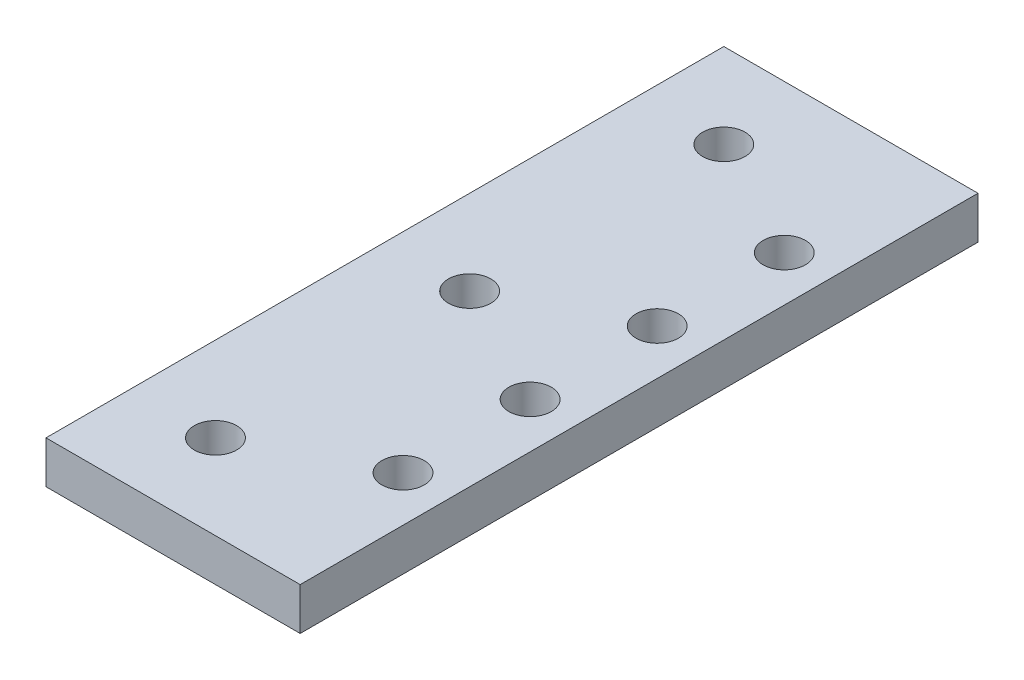
ISO-10303-21;
HEADER;
FILE_DESCRIPTION(('STEP AP214'),'2;1');
FILE_NAME('part.step','',(''),(''),'','','');
FILE_SCHEMA(('AUTOMOTIVE_DESIGN { 1 0 10303 214 1 1 1 1 }'));
ENDSEC;
DATA;
#1=APPLICATION_CONTEXT('core data for automotive mechanical design processes');
#2=APPLICATION_PROTOCOL_DEFINITION('international standard','automotive_design',2000,#1);
#3=PRODUCT_CONTEXT('',#1,'mechanical');
#4=PRODUCT('Part','Part','',(#3));
#5=PRODUCT_RELATED_PRODUCT_CATEGORY('part','',(#4));
#6=PRODUCT_DEFINITION_FORMATION('','',#4);
#7=PRODUCT_DEFINITION_CONTEXT('part definition',#1,'design');
#8=PRODUCT_DEFINITION('design','',#6,#7);
#9=PRODUCT_DEFINITION_SHAPE('','',#8);
#10=(LENGTH_UNIT() NAMED_UNIT(*) SI_UNIT(.MILLI.,.METRE.));
#11=(NAMED_UNIT(*) PLANE_ANGLE_UNIT() SI_UNIT($,.RADIAN.));
#12=(NAMED_UNIT(*) SI_UNIT($,.STERADIAN.) SOLID_ANGLE_UNIT());
#13=UNCERTAINTY_MEASURE_WITH_UNIT(LENGTH_MEASURE(1.E-05),#10,'distance_accuracy_value','');
#14=(GEOMETRIC_REPRESENTATION_CONTEXT(3) GLOBAL_UNCERTAINTY_ASSIGNED_CONTEXT((#13)) GLOBAL_UNIT_ASSIGNED_CONTEXT((#10,
#11,#12)) REPRESENTATION_CONTEXT('',''));
#15=CARTESIAN_POINT('',(0.,0.,0.));
#16=DIRECTION('',(0.,0.,1.));
#17=DIRECTION('',(1.,0.,0.));
#18=AXIS2_PLACEMENT_3D('',#15,#16,#17);
#19=CARTESIAN_POINT('',(0.,6.35,0.));
#20=DIRECTION('',(0.,-1.,0.));
#21=DIRECTION('',(0.,0.,-1.));
#22=AXIS2_PLACEMENT_3D('',#19,#20,#21);
#23=PLANE('',#22);
#24=CARTESIAN_POINT('',(18.589627450316,6.35,-28.575));
#25=DIRECTION('',(0.,1.,0.));
#26=DIRECTION('',(0.,0.,1.));
#27=AXIS2_PLACEMENT_3D('',#24,#25,#26);
#28=CIRCLE('',#27,3.175);
#29=CARTESIAN_POINT('',(18.589627450316,6.35,-25.4));
#30=VERTEX_POINT('',#29);
#31=EDGE_CURVE('E184',#30,#30,#28,.T.);
#32=ORIENTED_EDGE('',*,*,#31,.F.);
#33=EDGE_LOOP('',(#32));
#34=FACE_BOUND('',#33,.T.);
#35=CARTESIAN_POINT('',(18.589627450316,6.35,-9.525));
#36=DIRECTION('',(0.,1.,0.));
#37=DIRECTION('',(0.,0.,1.));
#38=AXIS2_PLACEMENT_3D('',#35,#36,#37);
#39=CIRCLE('',#38,3.175);
#40=CARTESIAN_POINT('',(18.589627450316,6.35,-6.35));
#41=VERTEX_POINT('',#40);
#42=EDGE_CURVE('E180',#41,#41,#39,.T.);
#43=ORIENTED_EDGE('',*,*,#42,.F.);
#44=EDGE_LOOP('',(#43));
#45=FACE_BOUND('',#44,.T.);
#46=CARTESIAN_POINT('',(18.589627450316,6.35,9.525));
#47=DIRECTION('',(0.,1.,0.));
#48=DIRECTION('',(0.,0.,1.));
#49=AXIS2_PLACEMENT_3D('',#46,#47,#48);
#50=CIRCLE('',#49,3.175);
#51=CARTESIAN_POINT('',(18.589627450316,6.35,12.7));
#52=VERTEX_POINT('',#51);
#53=EDGE_CURVE('E172',#52,#52,#50,.T.);
#54=ORIENTED_EDGE('',*,*,#53,.F.);
#55=EDGE_LOOP('',(#54));
#56=FACE_BOUND('',#55,.T.);
#57=CARTESIAN_POINT('',(18.589627450316,6.35,28.575));
#58=DIRECTION('',(0.,1.,0.));
#59=DIRECTION('',(0.,0.,1.));
#60=AXIS2_PLACEMENT_3D('',#57,#58,#59);
#61=CIRCLE('',#60,3.175);
#62=CARTESIAN_POINT('',(18.589627450316,6.35,31.75));
#63=VERTEX_POINT('',#62);
#64=EDGE_CURVE('E164',#63,#63,#61,.T.);
#65=ORIENTED_EDGE('',*,*,#64,.F.);
#66=EDGE_LOOP('',(#65));
#67=FACE_BOUND('',#66,.T.);
#68=DIRECTION('',(0.,0.,1.));
#69=VECTOR('',#68,1.);
#70=CARTESIAN_POINT('',(-12.7,6.35,50.8));
#71=LINE('',#70,#69);
#72=CARTESIAN_POINT('',(-12.7,6.35,-50.8));
#73=VERTEX_POINT('',#72);
#74=CARTESIAN_POINT('',(-12.7,6.35,50.8));
#75=VERTEX_POINT('',#74);
#76=EDGE_CURVE('E98',#73,#75,#71,.T.);
#77=ORIENTED_EDGE('',*,*,#76,.T.);
#78=DIRECTION('',(1.,0.,0.));
#79=VECTOR('',#78,1.);
#80=CARTESIAN_POINT('',(-12.7,6.35,50.8));
#81=LINE('',#80,#79);
#82=CARTESIAN_POINT('',(25.4,6.35,50.8));
#83=VERTEX_POINT('',#82);
#84=EDGE_CURVE('E93',#75,#83,#81,.T.);
#85=ORIENTED_EDGE('',*,*,#84,.T.);
#86=DIRECTION('',(0.,0.,-1.));
#87=VECTOR('',#86,1.);
#88=CARTESIAN_POINT('',(25.4,6.35,50.8));
#89=LINE('',#88,#87);
#90=CARTESIAN_POINT('',(25.4,6.35,-50.8));
#91=VERTEX_POINT('',#90);
#92=EDGE_CURVE('E96',#83,#91,#89,.T.);
#93=ORIENTED_EDGE('',*,*,#92,.T.);
#94=DIRECTION('',(-1.,0.,0.));
#95=VECTOR('',#94,1.);
#96=CARTESIAN_POINT('',(-12.7,6.35,-50.8));
#97=LINE('',#96,#95);
#98=EDGE_CURVE('E63',#91,#73,#97,.T.);
#99=ORIENTED_EDGE('',*,*,#98,.T.);
#100=EDGE_LOOP('',(#77,#85,#93,#99));
#101=FACE_BOUND('',#100,.T.);
#102=CARTESIAN_POINT('',(0.,6.35,0.));
#103=DIRECTION('',(0.,1.,0.));
#104=DIRECTION('',(0.,0.,1.));
#105=AXIS2_PLACEMENT_3D('',#102,#103,#104);
#106=CIRCLE('',#105,3.175);
#107=CARTESIAN_POINT('',(0.,6.35,3.175));
#108=VERTEX_POINT('',#107);
#109=EDGE_CURVE('E118',#108,#108,#106,.T.);
#110=ORIENTED_EDGE('',*,*,#109,.F.);
#111=EDGE_LOOP('',(#110));
#112=FACE_BOUND('',#111,.T.);
#113=CARTESIAN_POINT('',(0.,6.35,-38.1));
#114=DIRECTION('',(0.,1.,0.));
#115=DIRECTION('',(0.,0.,1.));
#116=AXIS2_PLACEMENT_3D('',#113,#114,#115);
#117=CIRCLE('',#116,3.175);
#118=CARTESIAN_POINT('',(0.,6.35,-34.925));
#119=VERTEX_POINT('',#118);
#120=EDGE_CURVE('E140',#119,#119,#117,.T.);
#121=ORIENTED_EDGE('',*,*,#120,.F.);
#122=EDGE_LOOP('',(#121));
#123=FACE_BOUND('',#122,.T.);
#124=CARTESIAN_POINT('',(0.,6.35,38.1));
#125=DIRECTION('',(0.,1.,0.));
#126=DIRECTION('',(0.,0.,1.));
#127=AXIS2_PLACEMENT_3D('',#124,#125,#126);
#128=CIRCLE('',#127,3.175);
#129=CARTESIAN_POINT('',(0.,6.35,41.275));
#130=VERTEX_POINT('',#129);
#131=EDGE_CURVE('E148',#130,#130,#128,.T.);
#132=ORIENTED_EDGE('',*,*,#131,.F.);
#133=EDGE_LOOP('',(#132));
#134=FACE_BOUND('',#133,.T.);
#135=ADVANCED_FACE('F45',(#34,#45,#56,#67,#101,#112,#123,#134),#23,.F.);
#136=CARTESIAN_POINT('',(0.,0.,0.));
#137=DIRECTION('',(0.,-1.,0.));
#138=DIRECTION('',(0.,0.,-1.));
#139=AXIS2_PLACEMENT_3D('',#136,#137,#138);
#140=PLANE('',#139);
#141=CARTESIAN_POINT('',(18.589627450316,0.,-28.575));
#142=DIRECTION('',(0.,1.,0.));
#143=DIRECTION('',(0.,0.,1.));
#144=AXIS2_PLACEMENT_3D('',#141,#142,#143);
#145=CIRCLE('',#144,3.175);
#146=CARTESIAN_POINT('',(18.589627450316,0.,-25.4));
#147=VERTEX_POINT('',#146);
#148=EDGE_CURVE('E156',#147,#147,#145,.T.);
#149=ORIENTED_EDGE('',*,*,#148,.T.);
#150=EDGE_LOOP('',(#149));
#151=FACE_BOUND('',#150,.T.);
#152=CARTESIAN_POINT('',(18.589627450316,0.,-9.525));
#153=DIRECTION('',(0.,1.,0.));
#154=DIRECTION('',(0.,0.,1.));
#155=AXIS2_PLACEMENT_3D('',#152,#153,#154);
#156=CIRCLE('',#155,3.175);
#157=CARTESIAN_POINT('',(18.589627450316,0.,-6.35));
#158=VERTEX_POINT('',#157);
#159=EDGE_CURVE('E176',#158,#158,#156,.T.);
#160=ORIENTED_EDGE('',*,*,#159,.T.);
#161=EDGE_LOOP('',(#160));
#162=FACE_BOUND('',#161,.T.);
#163=CARTESIAN_POINT('',(18.589627450316,0.,9.525));
#164=DIRECTION('',(0.,1.,0.));
#165=DIRECTION('',(0.,0.,1.));
#166=AXIS2_PLACEMENT_3D('',#163,#164,#165);
#167=CIRCLE('',#166,3.175);
#168=CARTESIAN_POINT('',(18.589627450316,0.,12.7));
#169=VERTEX_POINT('',#168);
#170=EDGE_CURVE('E168',#169,#169,#167,.T.);
#171=ORIENTED_EDGE('',*,*,#170,.T.);
#172=EDGE_LOOP('',(#171));
#173=FACE_BOUND('',#172,.T.);
#174=CARTESIAN_POINT('',(18.589627450316,0.,28.575));
#175=DIRECTION('',(0.,1.,0.));
#176=DIRECTION('',(0.,0.,1.));
#177=AXIS2_PLACEMENT_3D('',#174,#175,#176);
#178=CIRCLE('',#177,3.175);
#179=CARTESIAN_POINT('',(18.589627450316,0.,31.75));
#180=VERTEX_POINT('',#179);
#181=EDGE_CURVE('E160',#180,#180,#178,.T.);
#182=ORIENTED_EDGE('',*,*,#181,.T.);
#183=EDGE_LOOP('',(#182));
#184=FACE_BOUND('',#183,.T.);
#185=CARTESIAN_POINT('',(0.,0.,-38.1));
#186=DIRECTION('',(0.,1.,0.));
#187=DIRECTION('',(0.,0.,1.));
#188=AXIS2_PLACEMENT_3D('',#185,#186,#187);
#189=CIRCLE('',#188,3.175);
#190=CARTESIAN_POINT('',(0.,0.,-34.925));
#191=VERTEX_POINT('',#190);
#192=EDGE_CURVE('E144',#191,#191,#189,.T.);
#193=ORIENTED_EDGE('',*,*,#192,.T.);
#194=EDGE_LOOP('',(#193));
#195=FACE_BOUND('',#194,.T.);
#196=DIRECTION('',(0.,0.,1.));
#197=VECTOR('',#196,1.);
#198=CARTESIAN_POINT('',(-12.7,0.,50.8));
#199=LINE('',#198,#197);
#200=CARTESIAN_POINT('',(-12.7,0.,-50.8));
#201=VERTEX_POINT('',#200);
#202=CARTESIAN_POINT('',(-12.7,0.,50.8));
#203=VERTEX_POINT('',#202);
#204=EDGE_CURVE('E114',#201,#203,#199,.T.);
#205=ORIENTED_EDGE('',*,*,#204,.F.);
#206=DIRECTION('',(-1.,0.,0.));
#207=VECTOR('',#206,1.);
#208=CARTESIAN_POINT('',(-12.7,0.,-50.8));
#209=LINE('',#208,#207);
#210=CARTESIAN_POINT('',(25.4,0.,-50.8));
#211=VERTEX_POINT('',#210);
#212=EDGE_CURVE('E86',#211,#201,#209,.T.);
#213=ORIENTED_EDGE('',*,*,#212,.F.);
#214=DIRECTION('',(0.,0.,-1.));
#215=VECTOR('',#214,1.);
#216=CARTESIAN_POINT('',(25.4,0.,50.8));
#217=LINE('',#216,#215);
#218=CARTESIAN_POINT('',(25.4,0.,50.8));
#219=VERTEX_POINT('',#218);
#220=EDGE_CURVE('E80',#219,#211,#217,.T.);
#221=ORIENTED_EDGE('',*,*,#220,.F.);
#222=DIRECTION('',(1.,0.,0.));
#223=VECTOR('',#222,1.);
#224=CARTESIAN_POINT('',(-12.7,0.,50.8));
#225=LINE('',#224,#223);
#226=EDGE_CURVE('E103',#203,#219,#225,.T.);
#227=ORIENTED_EDGE('',*,*,#226,.F.);
#228=EDGE_LOOP('',(#205,#213,#221,#227));
#229=FACE_BOUND('',#228,.T.);
#230=CARTESIAN_POINT('',(0.,0.,0.));
#231=DIRECTION('',(0.,1.,0.));
#232=DIRECTION('',(0.,0.,1.));
#233=AXIS2_PLACEMENT_3D('',#230,#231,#232);
#234=CIRCLE('',#233,3.175);
#235=CARTESIAN_POINT('',(0.,0.,3.175));
#236=VERTEX_POINT('',#235);
#237=EDGE_CURVE('E136',#236,#236,#234,.T.);
#238=ORIENTED_EDGE('',*,*,#237,.T.);
#239=EDGE_LOOP('',(#238));
#240=FACE_BOUND('',#239,.T.);
#241=CARTESIAN_POINT('',(0.,0.,38.1));
#242=DIRECTION('',(0.,1.,0.));
#243=DIRECTION('',(0.,0.,1.));
#244=AXIS2_PLACEMENT_3D('',#241,#242,#243);
#245=CIRCLE('',#244,3.175);
#246=CARTESIAN_POINT('',(0.,0.,41.275));
#247=VERTEX_POINT('',#246);
#248=EDGE_CURVE('E152',#247,#247,#245,.T.);
#249=ORIENTED_EDGE('',*,*,#248,.T.);
#250=EDGE_LOOP('',(#249));
#251=FACE_BOUND('',#250,.T.);
#252=ADVANCED_FACE('F131',(#151,#162,#173,#184,#195,#229,#240,#251),#140,.T.);
#253=CARTESIAN_POINT('',(-12.7,6.35,50.8));
#254=DIRECTION('',(1.,0.,0.));
#255=DIRECTION('',(0.,0.,-1.));
#256=AXIS2_PLACEMENT_3D('',#253,#254,#255);
#257=PLANE('',#256);
#258=ORIENTED_EDGE('',*,*,#204,.T.);
#259=DIRECTION('',(0.,-1.,0.));
#260=VECTOR('',#259,1.);
#261=CARTESIAN_POINT('',(-12.7,6.35,50.8));
#262=LINE('',#261,#260);
#263=EDGE_CURVE('E11',#75,#203,#262,.T.);
#264=ORIENTED_EDGE('',*,*,#263,.F.);
#265=ORIENTED_EDGE('',*,*,#76,.F.);
#266=DIRECTION('',(0.,-1.,0.));
#267=VECTOR('',#266,1.);
#268=CARTESIAN_POINT('',(-12.7,6.35,-50.8));
#269=LINE('',#268,#267);
#270=EDGE_CURVE('E110',#73,#201,#269,.T.);
#271=ORIENTED_EDGE('',*,*,#270,.T.);
#272=EDGE_LOOP('',(#258,#264,#265,#271));
#273=FACE_BOUND('',#272,.T.);
#274=ADVANCED_FACE('F47',(#273),#257,.F.);
#275=CARTESIAN_POINT('',(-12.7,6.35,50.8));
#276=DIRECTION('',(0.,0.,-1.));
#277=DIRECTION('',(-1.,0.,0.));
#278=AXIS2_PLACEMENT_3D('',#275,#276,#277);
#279=PLANE('',#278);
#280=ORIENTED_EDGE('',*,*,#226,.T.);
#281=DIRECTION('',(0.,-1.,0.));
#282=VECTOR('',#281,1.);
#283=CARTESIAN_POINT('',(25.4,6.35,50.8));
#284=LINE('',#283,#282);
#285=EDGE_CURVE('E55',#83,#219,#284,.T.);
#286=ORIENTED_EDGE('',*,*,#285,.F.);
#287=ORIENTED_EDGE('',*,*,#84,.F.);
#288=ORIENTED_EDGE('',*,*,#263,.T.);
#289=EDGE_LOOP('',(#280,#286,#287,#288));
#290=FACE_BOUND('',#289,.T.);
#291=ADVANCED_FACE('F102',(#290),#279,.F.);
#292=CARTESIAN_POINT('',(25.4,6.35,50.8));
#293=DIRECTION('',(-1.,0.,0.));
#294=DIRECTION('',(0.,0.,1.));
#295=AXIS2_PLACEMENT_3D('',#292,#293,#294);
#296=PLANE('',#295);
#297=ORIENTED_EDGE('',*,*,#220,.T.);
#298=DIRECTION('',(0.,-1.,0.));
#299=VECTOR('',#298,1.);
#300=CARTESIAN_POINT('',(25.4,6.35,-50.8));
#301=LINE('',#300,#299);
#302=EDGE_CURVE('E105',#91,#211,#301,.T.);
#303=ORIENTED_EDGE('',*,*,#302,.F.);
#304=ORIENTED_EDGE('',*,*,#92,.F.);
#305=ORIENTED_EDGE('',*,*,#285,.T.);
#306=EDGE_LOOP('',(#297,#303,#304,#305));
#307=FACE_BOUND('',#306,.T.);
#308=ADVANCED_FACE('F106',(#307),#296,.F.);
#309=CARTESIAN_POINT('',(-12.7,6.35,-50.8));
#310=DIRECTION('',(0.,0.,1.));
#311=DIRECTION('',(1.,0.,0.));
#312=AXIS2_PLACEMENT_3D('',#309,#310,#311);
#313=PLANE('',#312);
#314=ORIENTED_EDGE('',*,*,#212,.T.);
#315=ORIENTED_EDGE('',*,*,#270,.F.);
#316=ORIENTED_EDGE('',*,*,#98,.F.);
#317=ORIENTED_EDGE('',*,*,#302,.T.);
#318=EDGE_LOOP('',(#314,#315,#316,#317));
#319=FACE_BOUND('',#318,.T.);
#320=ADVANCED_FACE('F128',(#319),#313,.F.);
#321=CARTESIAN_POINT('',(0.,6.35,0.));
#322=DIRECTION('',(0.,-1.,0.));
#323=DIRECTION('',(0.,0.,-1.));
#324=AXIS2_PLACEMENT_3D('',#321,#322,#323);
#325=CYLINDRICAL_SURFACE('',#324,3.175);
#326=ORIENTED_EDGE('',*,*,#109,.T.);
#327=EDGE_LOOP('',(#326));
#328=FACE_BOUND('',#327,.T.);
#329=ORIENTED_EDGE('',*,*,#237,.F.);
#330=EDGE_LOOP('',(#329));
#331=FACE_BOUND('',#330,.T.);
#332=ADVANCED_FACE('F230',(#328,#331),#325,.F.);
#333=CARTESIAN_POINT('',(0.,6.35,-38.1));
#334=DIRECTION('',(0.,-1.,0.));
#335=DIRECTION('',(0.,0.,-1.));
#336=AXIS2_PLACEMENT_3D('',#333,#334,#335);
#337=CYLINDRICAL_SURFACE('',#336,3.175);
#338=ORIENTED_EDGE('',*,*,#120,.T.);
#339=EDGE_LOOP('',(#338));
#340=FACE_BOUND('',#339,.T.);
#341=ORIENTED_EDGE('',*,*,#192,.F.);
#342=EDGE_LOOP('',(#341));
#343=FACE_BOUND('',#342,.T.);
#344=ADVANCED_FACE('F222',(#340,#343),#337,.F.);
#345=CARTESIAN_POINT('',(0.,6.35,38.1));
#346=DIRECTION('',(0.,-1.,0.));
#347=DIRECTION('',(0.,0.,-1.));
#348=AXIS2_PLACEMENT_3D('',#345,#346,#347);
#349=CYLINDRICAL_SURFACE('',#348,3.175);
#350=ORIENTED_EDGE('',*,*,#131,.T.);
#351=EDGE_LOOP('',(#350));
#352=FACE_BOUND('',#351,.T.);
#353=ORIENTED_EDGE('',*,*,#248,.F.);
#354=EDGE_LOOP('',(#353));
#355=FACE_BOUND('',#354,.T.);
#356=ADVANCED_FACE('F213',(#352,#355),#349,.F.);
#357=CARTESIAN_POINT('',(18.589627450316,0.,28.575));
#358=DIRECTION('',(0.,1.,0.));
#359=DIRECTION('',(0.,0.,1.));
#360=AXIS2_PLACEMENT_3D('',#357,#358,#359);
#361=CYLINDRICAL_SURFACE('',#360,3.175);
#362=ORIENTED_EDGE('',*,*,#181,.F.);
#363=EDGE_LOOP('',(#362));
#364=FACE_BOUND('',#363,.T.);
#365=ORIENTED_EDGE('',*,*,#64,.T.);
#366=EDGE_LOOP('',(#365));
#367=FACE_BOUND('',#366,.T.);
#368=ADVANCED_FACE('F210',(#364,#367),#361,.F.);
#369=CARTESIAN_POINT('',(18.589627450316,0.,9.525));
#370=DIRECTION('',(0.,1.,0.));
#371=DIRECTION('',(0.,0.,1.));
#372=AXIS2_PLACEMENT_3D('',#369,#370,#371);
#373=CYLINDRICAL_SURFACE('',#372,3.175);
#374=ORIENTED_EDGE('',*,*,#170,.F.);
#375=EDGE_LOOP('',(#374));
#376=FACE_BOUND('',#375,.T.);
#377=ORIENTED_EDGE('',*,*,#53,.T.);
#378=EDGE_LOOP('',(#377));
#379=FACE_BOUND('',#378,.T.);
#380=ADVANCED_FACE('F212',(#376,#379),#373,.F.);
#381=CARTESIAN_POINT('',(18.589627450316,0.,-9.525));
#382=DIRECTION('',(0.,1.,0.));
#383=DIRECTION('',(0.,0.,1.));
#384=AXIS2_PLACEMENT_3D('',#381,#382,#383);
#385=CYLINDRICAL_SURFACE('',#384,3.175);
#386=ORIENTED_EDGE('',*,*,#159,.F.);
#387=EDGE_LOOP('',(#386));
#388=FACE_BOUND('',#387,.T.);
#389=ORIENTED_EDGE('',*,*,#42,.T.);
#390=EDGE_LOOP('',(#389));
#391=FACE_BOUND('',#390,.T.);
#392=ADVANCED_FACE('F197',(#388,#391),#385,.F.);
#393=CARTESIAN_POINT('',(18.589627450316,0.,-28.575));
#394=DIRECTION('',(0.,1.,0.));
#395=DIRECTION('',(0.,0.,1.));
#396=AXIS2_PLACEMENT_3D('',#393,#394,#395);
#397=CYLINDRICAL_SURFACE('',#396,3.175);
#398=ORIENTED_EDGE('',*,*,#148,.F.);
#399=EDGE_LOOP('',(#398));
#400=FACE_BOUND('',#399,.T.);
#401=ORIENTED_EDGE('',*,*,#31,.T.);
#402=EDGE_LOOP('',(#401));
#403=FACE_BOUND('',#402,.T.);
#404=ADVANCED_FACE('F194',(#400,#403),#397,.F.);
#405=CLOSED_SHELL('',(#135,#252,#274,#291,#308,#320,#332,#344,#356,#368,#380,#392,#404));
#406=MANIFOLD_SOLID_BREP('B2',#405);
#407=ADVANCED_BREP_SHAPE_REPRESENTATION('',(#18,#406),#14);
#408=SHAPE_DEFINITION_REPRESENTATION(#9,#407);
ENDSEC;
END-ISO-10303-21;
